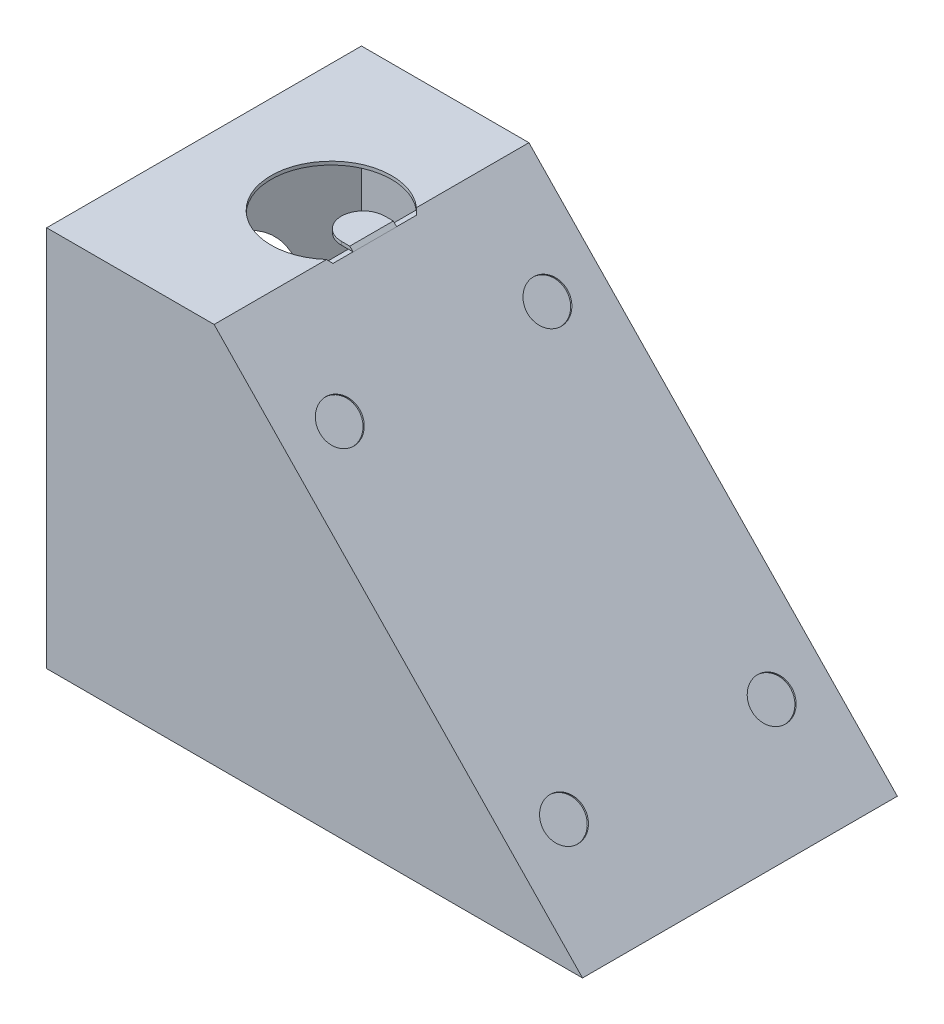
ISO-10303-21;
HEADER;
FILE_DESCRIPTION(('STEP AP214'),'2;1');
FILE_NAME('part.step','',(''),(''),'','','');
FILE_SCHEMA(('AUTOMOTIVE_DESIGN { 1 0 10303 214 1 1 1 1 }'));
ENDSEC;
DATA;
#1=APPLICATION_CONTEXT('core data for automotive mechanical design processes');
#2=APPLICATION_PROTOCOL_DEFINITION('international standard','automotive_design',2000,#1);
#3=PRODUCT_CONTEXT('',#1,'mechanical');
#4=PRODUCT('Part','Part','',(#3));
#5=PRODUCT_RELATED_PRODUCT_CATEGORY('part','',(#4));
#6=PRODUCT_DEFINITION_FORMATION('','',#4);
#7=PRODUCT_DEFINITION_CONTEXT('part definition',#1,'design');
#8=PRODUCT_DEFINITION('design','',#6,#7);
#9=PRODUCT_DEFINITION_SHAPE('','',#8);
#10=(LENGTH_UNIT() NAMED_UNIT(*) SI_UNIT(.MILLI.,.METRE.));
#11=(NAMED_UNIT(*) PLANE_ANGLE_UNIT() SI_UNIT($,.RADIAN.));
#12=(NAMED_UNIT(*) SI_UNIT($,.STERADIAN.) SOLID_ANGLE_UNIT());
#13=UNCERTAINTY_MEASURE_WITH_UNIT(LENGTH_MEASURE(1.E-05),#10,'distance_accuracy_value','');
#14=(GEOMETRIC_REPRESENTATION_CONTEXT(3) GLOBAL_UNCERTAINTY_ASSIGNED_CONTEXT((#13)) GLOBAL_UNIT_ASSIGNED_CONTEXT((#10,
#11,#12)) REPRESENTATION_CONTEXT('',''));
#15=CARTESIAN_POINT('',(0.,0.,0.));
#16=DIRECTION('',(0.,0.,1.));
#17=DIRECTION('',(1.,0.,0.));
#18=AXIS2_PLACEMENT_3D('',#15,#16,#17);
#19=CARTESIAN_POINT('',(12.517216783659,28.7796302298464,-23.876));
#20=DIRECTION('',(0.719618961972478,0.694369173833093,0.));
#21=DIRECTION('',(-0.694369173833093,0.719618961972478,0.));
#22=AXIS2_PLACEMENT_3D('',#19,#20,#21);
#23=PLANE('',#22);
#24=DIRECTION('',(-0.694369173833093,0.719618961972478,0.));
#25=VECTOR('',#24,1.);
#26=CARTESIAN_POINT('',(12.517216783659,28.7796302298464,-10.287));
#27=LINE('',#26,#25);
#28=CARTESIAN_POINT('',(40.2870354264932,0.,-10.287));
#29=VERTEX_POINT('',#28);
#30=CARTESIAN_POINT('',(40.041947707195,0.254000000000004,-10.287));
#31=VERTEX_POINT('',#30);
#32=EDGE_CURVE('E11',#29,#31,#27,.T.);
#33=ORIENTED_EDGE('',*,*,#32,.F.);
#34=DIRECTION('',(0.,0.,1.));
#35=VECTOR('',#34,1.);
#36=CARTESIAN_POINT('',(40.2870354264932,0.,-23.876));
#37=LINE('',#36,#35);
#38=CARTESIAN_POINT('',(40.2870354264932,0.,-0.254));
#39=VERTEX_POINT('',#38);
#40=EDGE_CURVE('E311',#29,#39,#37,.T.);
#41=ORIENTED_EDGE('',*,*,#40,.T.);
#42=DIRECTION('',(-0.694369173833093,0.719618961972478,0.));
#43=VECTOR('',#42,1.);
#44=CARTESIAN_POINT('',(12.517216783659,28.7796302298464,-0.254000000000001));
#45=LINE('',#44,#43);
#46=CARTESIAN_POINT('',(12.5921231457915,28.702,-0.254));
#47=VERTEX_POINT('',#46);
#48=EDGE_CURVE('E296',#39,#47,#45,.T.);
#49=ORIENTED_EDGE('',*,*,#48,.T.);
#50=DIRECTION('',(0.,0.,1.));
#51=VECTOR('',#50,1.);
#52=CARTESIAN_POINT('',(12.5921231457915,28.702,-23.876));
#53=LINE('',#52,#51);
#54=CARTESIAN_POINT('',(12.5921231457915,28.702,-8.43673453054739));
#55=VERTEX_POINT('',#54);
#56=EDGE_CURVE('E299',#55,#47,#53,.T.);
#57=ORIENTED_EDGE('',*,*,#56,.F.);
#58=CARTESIAN_POINT('',(12.5921231457915,28.702,-10.287));
#59=VERTEX_POINT('',#58);
#60=EDGE_CURVE('E249',#59,#55,#53,.T.);
#61=ORIENTED_EDGE('',*,*,#60,.F.);
#62=CARTESIAN_POINT('',(12.5921231457915,28.702,-13.589));
#63=VERTEX_POINT('',#62);
#64=EDGE_CURVE('E477',#63,#59,#53,.T.);
#65=ORIENTED_EDGE('',*,*,#64,.F.);
#66=CARTESIAN_POINT('',(12.5921231457915,28.702,-15.4392654694526));
#67=VERTEX_POINT('',#66);
#68=EDGE_CURVE('E260',#67,#63,#53,.T.);
#69=ORIENTED_EDGE('',*,*,#68,.F.);
#70=CARTESIAN_POINT('',(12.5921231457915,28.702,-23.622));
#71=VERTEX_POINT('',#70);
#72=EDGE_CURVE('E288',#71,#67,#53,.T.);
#73=ORIENTED_EDGE('',*,*,#72,.F.);
#74=DIRECTION('',(-0.694369173833093,0.719618961972478,0.));
#75=VECTOR('',#74,1.);
#76=CARTESIAN_POINT('',(12.517216783659,28.7796302298464,-23.622));
#77=LINE('',#76,#75);
#78=CARTESIAN_POINT('',(40.2870354264932,0.,-23.622));
#79=VERTEX_POINT('',#78);
#80=EDGE_CURVE('E304',#79,#71,#77,.T.);
#81=ORIENTED_EDGE('',*,*,#80,.F.);
#82=CARTESIAN_POINT('',(40.2870354264932,0.,-13.589));
#83=VERTEX_POINT('',#82);
#84=EDGE_CURVE('E313',#79,#83,#37,.T.);
#85=ORIENTED_EDGE('',*,*,#84,.T.);
#86=DIRECTION('',(0.694369173833093,-0.719618961972478,0.));
#87=VECTOR('',#86,1.);
#88=CARTESIAN_POINT('',(12.517216783659,28.7796302298464,-13.589));
#89=LINE('',#88,#87);
#90=CARTESIAN_POINT('',(40.041947707195,0.254000000000004,-13.589));
#91=VERTEX_POINT('',#90);
#92=EDGE_CURVE('E51',#91,#83,#89,.T.);
#93=ORIENTED_EDGE('',*,*,#92,.F.);
#94=DIRECTION('',(0.,0.,-1.));
#95=VECTOR('',#94,1.);
#96=CARTESIAN_POINT('',(40.041947707195,0.254000000000004,-23.876));
#97=LINE('',#96,#95);
#98=EDGE_CURVE('E61',#31,#91,#97,.T.);
#99=ORIENTED_EDGE('',*,*,#98,.F.);
#100=EDGE_LOOP('',(#33,#41,#49,#57,#61,#65,#69,#73,#81,#85,#93,#99));
#101=FACE_BOUND('',#100,.T.);
#102=ADVANCED_FACE('F42',(#101),#23,.F.);
#103=CARTESIAN_POINT('',(9.652,28.702,-11.938));
#104=DIRECTION('',(0.,1.,0.));
#105=DIRECTION('',(0.,0.,1.));
#106=AXIS2_PLACEMENT_3D('',#103,#104,#105);
#107=PLANE('',#106);
#108=DIRECTION('',(0.,0.,1.));
#109=VECTOR('',#108,1.);
#110=CARTESIAN_POINT('',(12.9450877192982,28.702,-23.876));
#111=LINE('',#110,#109);
#112=CARTESIAN_POINT('',(12.9450877192982,28.702,-10.287));
#113=VERTEX_POINT('',#112);
#114=CARTESIAN_POINT('',(12.9450877192982,28.702,-8.76644560617241));
#115=VERTEX_POINT('',#114);
#116=EDGE_CURVE('E353',#113,#115,#111,.T.);
#117=ORIENTED_EDGE('',*,*,#116,.F.);
#118=DIRECTION('',(1.,0.,0.));
#119=VECTOR('',#118,1.);
#120=CARTESIAN_POINT('',(9.652,28.702,-10.287));
#121=LINE('',#120,#119);
#122=EDGE_CURVE('E362',#59,#113,#121,.T.);
#123=ORIENTED_EDGE('',*,*,#122,.F.);
#124=ORIENTED_EDGE('',*,*,#60,.T.);
#125=CARTESIAN_POINT('',(9.652,28.702,-11.938));
#126=DIRECTION('',(0.,1.,0.));
#127=DIRECTION('',(0.,0.,1.));
#128=AXIS2_PLACEMENT_3D('',#125,#126,#127);
#129=CIRCLE('',#128,4.572);
#130=EDGE_CURVE('E246',#55,#115,#129,.T.);
#131=ORIENTED_EDGE('',*,*,#130,.T.);
#132=EDGE_LOOP('',(#117,#123,#124,#131));
#133=FACE_BOUND('',#132,.T.);
#134=ADVANCED_FACE('F379',(#133),#107,.T.);
#135=DIRECTION('',(1.,0.,0.));
#136=VECTOR('',#135,1.);
#137=CARTESIAN_POINT('',(9.652,28.702,-13.589));
#138=LINE('',#137,#136);
#139=CARTESIAN_POINT('',(12.9450877192982,28.702,-13.589));
#140=VERTEX_POINT('',#139);
#141=EDGE_CURVE('E360',#63,#140,#138,.T.);
#142=ORIENTED_EDGE('',*,*,#141,.T.);
#143=CARTESIAN_POINT('',(12.9450877192982,28.702,-15.1095543938276));
#144=VERTEX_POINT('',#143);
#145=EDGE_CURVE('E354',#144,#140,#111,.T.);
#146=ORIENTED_EDGE('',*,*,#145,.F.);
#147=EDGE_CURVE('E250',#144,#67,#129,.T.);
#148=ORIENTED_EDGE('',*,*,#147,.T.);
#149=ORIENTED_EDGE('',*,*,#68,.T.);
#150=EDGE_LOOP('',(#142,#146,#148,#149));
#151=FACE_BOUND('',#150,.T.);
#152=ADVANCED_FACE('F384',(#151),#107,.T.);
#153=CARTESIAN_POINT('',(10.414,28.702,-10.287));
#154=DIRECTION('',(0.,1.,0.));
#155=DIRECTION('',(0.,0.,1.));
#156=AXIS2_PLACEMENT_3D('',#153,#154,#155);
#157=PLANE('',#156);
#158=CARTESIAN_POINT('',(12.065,28.702,-11.938));
#159=DIRECTION('',(0.,1.,0.));
#160=DIRECTION('',(0.,0.,1.));
#161=AXIS2_PLACEMENT_3D('',#158,#159,#160);
#162=CIRCLE('',#161,1.651);
#163=CARTESIAN_POINT('',(12.0649999999999,28.702,-13.589));
#164=VERTEX_POINT('',#163);
#165=CARTESIAN_POINT('',(12.065,28.702,-10.287));
#166=VERTEX_POINT('',#165);
#167=EDGE_CURVE('E235',#164,#166,#162,.T.);
#168=ORIENTED_EDGE('',*,*,#167,.F.);
#169=DIRECTION('',(1.,0.,0.));
#170=VECTOR('',#169,1.);
#171=CARTESIAN_POINT('',(10.414,28.702,-13.589));
#172=LINE('',#171,#170);
#173=EDGE_CURVE('E241',#164,#63,#172,.T.);
#174=ORIENTED_EDGE('',*,*,#173,.T.);
#175=ORIENTED_EDGE('',*,*,#64,.T.);
#176=DIRECTION('',(1.,0.,0.));
#177=VECTOR('',#176,1.);
#178=CARTESIAN_POINT('',(10.414,28.702,-10.287));
#179=LINE('',#178,#177);
#180=EDGE_CURVE('E240',#166,#59,#179,.T.);
#181=ORIENTED_EDGE('',*,*,#180,.F.);
#182=EDGE_LOOP('',(#168,#174,#175,#181));
#183=FACE_BOUND('',#182,.T.);
#184=ADVANCED_FACE('F475',(#183),#157,.F.);
#185=CARTESIAN_POINT('',(12.7,28.956,-10.287));
#186=DIRECTION('',(0.,-1.,0.));
#187=DIRECTION('',(0.,0.,-1.));
#188=AXIS2_PLACEMENT_3D('',#185,#186,#187);
#189=PLANE('',#188);
#190=DIRECTION('',(-1.,0.,0.));
#191=VECTOR('',#190,1.);
#192=CARTESIAN_POINT('',(12.7,28.956,-10.287));
#193=LINE('',#192,#191);
#194=CARTESIAN_POINT('',(12.7,28.956,-10.287));
#195=VERTEX_POINT('',#194);
#196=CARTESIAN_POINT('',(12.065,28.956,-10.287));
#197=VERTEX_POINT('',#196);
#198=EDGE_CURVE('E238',#195,#197,#193,.T.);
#199=ORIENTED_EDGE('',*,*,#198,.F.);
#200=DIRECTION('',(0.,0.,1.));
#201=VECTOR('',#200,1.);
#202=CARTESIAN_POINT('',(12.7,28.956,-14.605));
#203=LINE('',#202,#201);
#204=CARTESIAN_POINT('',(12.7,28.956,-13.589));
#205=VERTEX_POINT('',#204);
#206=EDGE_CURVE('E213',#205,#195,#203,.T.);
#207=ORIENTED_EDGE('',*,*,#206,.F.);
#208=DIRECTION('',(-1.,0.,0.));
#209=VECTOR('',#208,1.);
#210=CARTESIAN_POINT('',(12.7,28.956,-13.589));
#211=LINE('',#210,#209);
#212=CARTESIAN_POINT('',(12.0649999999999,28.956,-13.589));
#213=VERTEX_POINT('',#212);
#214=EDGE_CURVE('E237',#205,#213,#211,.T.);
#215=ORIENTED_EDGE('',*,*,#214,.T.);
#216=CARTESIAN_POINT('',(12.065,28.956,-11.938));
#217=DIRECTION('',(0.,1.,0.));
#218=DIRECTION('',(0.,0.,1.));
#219=AXIS2_PLACEMENT_3D('',#216,#217,#218);
#220=CIRCLE('',#219,1.651);
#221=EDGE_CURVE('E232',#213,#197,#220,.T.);
#222=ORIENTED_EDGE('',*,*,#221,.T.);
#223=EDGE_LOOP('',(#199,#207,#215,#222));
#224=FACE_BOUND('',#223,.T.);
#225=ADVANCED_FACE('F418',(#224),#189,.F.);
#226=CARTESIAN_POINT('',(0.,0.,-23.876));
#227=DIRECTION('',(0.,-1.,0.));
#228=DIRECTION('',(0.,0.,-1.));
#229=AXIS2_PLACEMENT_3D('',#226,#227,#228);
#230=PLANE('',#229);
#231=DIRECTION('',(1.,0.,0.));
#232=VECTOR('',#231,1.);
#233=CARTESIAN_POINT('',(0.,0.,0.));
#234=LINE('',#233,#232);
#235=CARTESIAN_POINT('',(0.,0.,0.));
#236=VERTEX_POINT('',#235);
#237=CARTESIAN_POINT('',(40.64,0.,0.));
#238=VERTEX_POINT('',#237);
#239=EDGE_CURVE('E333',#236,#238,#234,.T.);
#240=ORIENTED_EDGE('',*,*,#239,.F.);
#241=DIRECTION('',(0.,0.,1.));
#242=VECTOR('',#241,1.);
#243=CARTESIAN_POINT('',(0.,0.,-23.876));
#244=LINE('',#243,#242);
#245=CARTESIAN_POINT('',(0.,0.,-23.876));
#246=VERTEX_POINT('',#245);
#247=EDGE_CURVE('E330',#246,#236,#244,.T.);
#248=ORIENTED_EDGE('',*,*,#247,.F.);
#249=DIRECTION('',(1.,0.,0.));
#250=VECTOR('',#249,1.);
#251=CARTESIAN_POINT('',(0.,0.,-23.876));
#252=LINE('',#251,#250);
#253=CARTESIAN_POINT('',(40.64,0.,-23.876));
#254=VERTEX_POINT('',#253);
#255=EDGE_CURVE('E320',#246,#254,#252,.T.);
#256=ORIENTED_EDGE('',*,*,#255,.T.);
#257=DIRECTION('',(0.,0.,1.));
#258=VECTOR('',#257,1.);
#259=CARTESIAN_POINT('',(40.64,0.,-23.876));
#260=LINE('',#259,#258);
#261=EDGE_CURVE('E348',#254,#238,#260,.T.);
#262=ORIENTED_EDGE('',*,*,#261,.T.);
#263=EDGE_LOOP('',(#240,#248,#256,#262));
#264=FACE_BOUND('',#263,.T.);
#265=DIRECTION('',(0.,0.,1.));
#266=VECTOR('',#265,1.);
#267=CARTESIAN_POINT('',(0.254,0.,-23.876));
#268=LINE('',#267,#266);
#269=CARTESIAN_POINT('',(0.254,0.,-23.622));
#270=VERTEX_POINT('',#269);
#271=CARTESIAN_POINT('',(0.254,0.,-0.254));
#272=VERTEX_POINT('',#271);
#273=EDGE_CURVE('E303',#270,#272,#268,.T.);
#274=ORIENTED_EDGE('',*,*,#273,.T.);
#275=DIRECTION('',(1.,0.,0.));
#276=VECTOR('',#275,1.);
#277=CARTESIAN_POINT('',(0.,0.,-0.254000000000001));
#278=LINE('',#277,#276);
#279=EDGE_CURVE('E284',#272,#39,#278,.T.);
#280=ORIENTED_EDGE('',*,*,#279,.T.);
#281=ORIENTED_EDGE('',*,*,#40,.F.);
#282=DIRECTION('',(1.,0.,0.));
#283=VECTOR('',#282,1.);
#284=CARTESIAN_POINT('',(0.,0.,-10.287));
#285=LINE('',#284,#283);
#286=CARTESIAN_POINT('',(39.6520354264932,0.,-10.287));
#287=VERTEX_POINT('',#286);
#288=EDGE_CURVE('E208',#287,#29,#285,.T.);
#289=ORIENTED_EDGE('',*,*,#288,.F.);
#290=CARTESIAN_POINT('',(39.6520354264932,0.,-11.938));
#291=DIRECTION('',(0.,-1.,0.));
#292=DIRECTION('',(0.,0.,-1.));
#293=AXIS2_PLACEMENT_3D('',#290,#291,#292);
#294=CIRCLE('',#293,1.651);
#295=CARTESIAN_POINT('',(39.6520354264932,0.,-13.589));
#296=VERTEX_POINT('',#295);
#297=EDGE_CURVE('E189',#287,#296,#294,.T.);
#298=ORIENTED_EDGE('',*,*,#297,.T.);
#299=DIRECTION('',(-1.,0.,0.));
#300=VECTOR('',#299,1.);
#301=CARTESIAN_POINT('',(0.,0.,-13.589));
#302=LINE('',#301,#300);
#303=EDGE_CURVE('E200',#83,#296,#302,.T.);
#304=ORIENTED_EDGE('',*,*,#303,.F.);
#305=ORIENTED_EDGE('',*,*,#84,.F.);
#306=DIRECTION('',(1.,0.,0.));
#307=VECTOR('',#306,1.);
#308=CARTESIAN_POINT('',(0.,0.,-23.622));
#309=LINE('',#308,#307);
#310=EDGE_CURVE('E292',#270,#79,#309,.T.);
#311=ORIENTED_EDGE('',*,*,#310,.F.);
#312=EDGE_LOOP('',(#274,#280,#281,#289,#298,#304,#305,#311));
#313=FACE_BOUND('',#312,.T.);
#314=ADVANCED_FACE('F375',(#264,#313),#230,.T.);
#315=CARTESIAN_POINT('',(0.,0.,-23.876));
#316=DIRECTION('',(-1.,0.,0.));
#317=DIRECTION('',(0.,0.,1.));
#318=AXIS2_PLACEMENT_3D('',#315,#316,#317);
#319=PLANE('',#318);
#320=CARTESIAN_POINT('',(0.,14.859,-11.938));
#321=DIRECTION('',(-1.,0.,0.));
#322=DIRECTION('',(0.,0.,1.));
#323=AXIS2_PLACEMENT_3D('',#320,#321,#322);
#324=CIRCLE('',#323,7.49300000000001);
#325=CARTESIAN_POINT('',(0.,14.859,-4.44499999999999));
#326=VERTEX_POINT('',#325);
#327=EDGE_CURVE('E343',#326,#326,#324,.F.);
#328=ORIENTED_EDGE('',*,*,#327,.T.);
#329=EDGE_LOOP('',(#328));
#330=FACE_BOUND('',#329,.T.);
#331=DIRECTION('',(0.,-1.,0.));
#332=VECTOR('',#331,1.);
#333=CARTESIAN_POINT('',(0.,0.,0.));
#334=LINE('',#333,#332);
#335=CARTESIAN_POINT('',(0.,28.956,0.));
#336=VERTEX_POINT('',#335);
#337=EDGE_CURVE('E287',#336,#236,#334,.T.);
#338=ORIENTED_EDGE('',*,*,#337,.F.);
#339=DIRECTION('',(0.,0.,1.));
#340=VECTOR('',#339,1.);
#341=CARTESIAN_POINT('',(0.,28.956,-23.876));
#342=LINE('',#341,#340);
#343=CARTESIAN_POINT('',(0.,28.956,-23.876));
#344=VERTEX_POINT('',#343);
#345=EDGE_CURVE('E341',#344,#336,#342,.T.);
#346=ORIENTED_EDGE('',*,*,#345,.F.);
#347=DIRECTION('',(0.,-1.,0.));
#348=VECTOR('',#347,1.);
#349=CARTESIAN_POINT('',(0.,0.,-23.876));
#350=LINE('',#349,#348);
#351=EDGE_CURVE('E317',#344,#246,#350,.T.);
#352=ORIENTED_EDGE('',*,*,#351,.T.);
#353=ORIENTED_EDGE('',*,*,#247,.T.);
#354=EDGE_LOOP('',(#338,#346,#352,#353));
#355=FACE_BOUND('',#354,.T.);
#356=ADVANCED_FACE('F412',(#330,#355),#319,.T.);
#357=CARTESIAN_POINT('',(0.,28.956,-23.876));
#358=DIRECTION('',(0.,1.,0.));
#359=DIRECTION('',(0.,0.,1.));
#360=AXIS2_PLACEMENT_3D('',#357,#358,#359);
#361=PLANE('',#360);
#362=CARTESIAN_POINT('',(9.652,28.956,-11.938));
#363=DIRECTION('',(0.,1.,0.));
#364=DIRECTION('',(0.,0.,1.));
#365=AXIS2_PLACEMENT_3D('',#362,#363,#364);
#366=CIRCLE('',#365,4.572);
#367=CARTESIAN_POINT('',(12.7,28.956,-15.3457675977097));
#368=VERTEX_POINT('',#367);
#369=CARTESIAN_POINT('',(12.7,28.956,-8.53023240229032));
#370=VERTEX_POINT('',#369);
#371=EDGE_CURVE('E243',#368,#370,#366,.T.);
#372=ORIENTED_EDGE('',*,*,#371,.F.);
#373=DIRECTION('',(0.,0.,1.));
#374=VECTOR('',#373,1.);
#375=CARTESIAN_POINT('',(12.7,28.956,-23.876));
#376=LINE('',#375,#374);
#377=CARTESIAN_POINT('',(12.7,28.956,-23.876));
#378=VERTEX_POINT('',#377);
#379=EDGE_CURVE('E344',#378,#368,#376,.T.);
#380=ORIENTED_EDGE('',*,*,#379,.F.);
#381=DIRECTION('',(-1.,0.,0.));
#382=VECTOR('',#381,1.);
#383=CARTESIAN_POINT('',(0.,28.956,-23.876));
#384=LINE('',#383,#382);
#385=EDGE_CURVE('E327',#378,#344,#384,.T.);
#386=ORIENTED_EDGE('',*,*,#385,.T.);
#387=ORIENTED_EDGE('',*,*,#345,.T.);
#388=DIRECTION('',(-1.,0.,0.));
#389=VECTOR('',#388,1.);
#390=CARTESIAN_POINT('',(0.,28.956,0.));
#391=LINE('',#390,#389);
#392=CARTESIAN_POINT('',(12.7,28.956,0.));
#393=VERTEX_POINT('',#392);
#394=EDGE_CURVE('E321',#393,#336,#391,.T.);
#395=ORIENTED_EDGE('',*,*,#394,.F.);
#396=EDGE_CURVE('E347',#370,#393,#376,.T.);
#397=ORIENTED_EDGE('',*,*,#396,.F.);
#398=EDGE_LOOP('',(#372,#380,#386,#387,#395,#397));
#399=FACE_BOUND('',#398,.T.);
#400=ADVANCED_FACE('F409',(#399),#361,.T.);
#401=CARTESIAN_POINT('',(12.7,28.956,-23.876));
#402=DIRECTION('',(0.719618961972478,0.694369173833093,0.));
#403=DIRECTION('',(-0.694369173833093,0.719618961972478,0.));
#404=AXIS2_PLACEMENT_3D('',#401,#402,#403);
#405=PLANE('',#404);
#406=CARTESIAN_POINT('',(9.652,32.1148363636364,-11.938));
#407=DIRECTION('',(0.719618961972478,0.694369173833093,0.));
#408=DIRECTION('',(-0.694369173833093,0.719618961972478,0.));
#409=AXIS2_PLACEMENT_3D('',#406,#407,#408);
#410=ELLIPSE('',#409,6.58439368032628,4.572);
#411=EDGE_CURVE('E359',#370,#115,#410,.T.);
#412=ORIENTED_EDGE('',*,*,#411,.F.);
#413=ORIENTED_EDGE('',*,*,#396,.T.);
#414=DIRECTION('',(-0.694369173833093,0.719618961972478,0.));
#415=VECTOR('',#414,1.);
#416=CARTESIAN_POINT('',(12.7,28.956,0.));
#417=LINE('',#416,#415);
#418=EDGE_CURVE('E336',#238,#393,#417,.T.);
#419=ORIENTED_EDGE('',*,*,#418,.F.);
#420=ORIENTED_EDGE('',*,*,#261,.F.);
#421=DIRECTION('',(-0.694369173833093,0.719618961972478,0.));
#422=VECTOR('',#421,1.);
#423=CARTESIAN_POINT('',(12.7,28.956,-23.876));
#424=LINE('',#423,#422);
#425=EDGE_CURVE('E324',#254,#378,#424,.T.);
#426=ORIENTED_EDGE('',*,*,#425,.T.);
#427=ORIENTED_EDGE('',*,*,#379,.T.);
#428=EDGE_CURVE('E357',#144,#368,#410,.T.);
#429=ORIENTED_EDGE('',*,*,#428,.F.);
#430=ORIENTED_EDGE('',*,*,#145,.T.);
#431=DIRECTION('',(0.,0.,1.));
#432=VECTOR('',#431,1.);
#433=CARTESIAN_POINT('',(12.9450877192982,28.702,-23.876));
#434=LINE('',#433,#432);
#435=EDGE_CURVE('E229',#140,#113,#434,.T.);
#436=ORIENTED_EDGE('',*,*,#435,.T.);
#437=ORIENTED_EDGE('',*,*,#116,.T.);
#438=EDGE_LOOP('',(#412,#413,#419,#420,#426,#427,#429,#430,#436,#437));
#439=FACE_BOUND('',#438,.T.);
#440=CARTESIAN_POINT('',(35.1725371252382,5.66627970657129,-19.812));
#441=DIRECTION('',(0.719618961972478,0.694369173833093,0.));
#442=DIRECTION('',(-0.694369173833093,0.719618961972478,0.));
#443=AXIS2_PLACEMENT_3D('',#440,#441,#442);
#444=CIRCLE('',#443,1.524);
#445=CARTESIAN_POINT('',(34.1143185043166,6.76297900461735,-19.812));
#446=VERTEX_POINT('',#445);
#447=EDGE_CURVE('E261',#446,#446,#444,.T.);
#448=ORIENTED_EDGE('',*,*,#447,.F.);
#449=EDGE_LOOP('',(#448));
#450=FACE_BOUND('',#449,.T.);
#451=CARTESIAN_POINT('',(18.1674628747618,23.2897202934287,-4.064));
#452=DIRECTION('',(0.719618961972478,0.694369173833093,0.));
#453=DIRECTION('',(-0.694369173833093,0.719618961972478,0.));
#454=AXIS2_PLACEMENT_3D('',#451,#452,#453);
#455=CIRCLE('',#454,1.524);
#456=CARTESIAN_POINT('',(17.1092442538401,24.3864195914748,-4.064));
#457=VERTEX_POINT('',#456);
#458=EDGE_CURVE('E268',#457,#457,#455,.T.);
#459=ORIENTED_EDGE('',*,*,#458,.F.);
#460=EDGE_LOOP('',(#459));
#461=FACE_BOUND('',#460,.T.);
#462=CARTESIAN_POINT('',(35.1725371252382,5.66627970657129,-4.064));
#463=DIRECTION('',(0.719618961972478,0.694369173833093,0.));
#464=DIRECTION('',(-0.694369173833093,0.719618961972478,0.));
#465=AXIS2_PLACEMENT_3D('',#462,#463,#464);
#466=CIRCLE('',#465,1.524);
#467=CARTESIAN_POINT('',(34.1143185043166,6.76297900461735,-4.064));
#468=VERTEX_POINT('',#467);
#469=EDGE_CURVE('E253',#468,#468,#466,.T.);
#470=ORIENTED_EDGE('',*,*,#469,.F.);
#471=EDGE_LOOP('',(#470));
#472=FACE_BOUND('',#471,.T.);
#473=CARTESIAN_POINT('',(18.1674628747618,23.2897202934287,-19.812));
#474=DIRECTION('',(0.719618961972478,0.694369173833093,0.));
#475=DIRECTION('',(-0.694369173833093,0.719618961972478,0.));
#476=AXIS2_PLACEMENT_3D('',#473,#474,#475);
#477=CIRCLE('',#476,1.524);
#478=CARTESIAN_POINT('',(17.1092442538401,24.3864195914748,-19.812));
#479=VERTEX_POINT('',#478);
#480=EDGE_CURVE('E264',#479,#479,#477,.T.);
#481=ORIENTED_EDGE('',*,*,#480,.F.);
#482=EDGE_LOOP('',(#481));
#483=FACE_BOUND('',#482,.T.);
#484=ADVANCED_FACE('F403',(#439,#450,#461,#472,#483),#405,.T.);
#485=CARTESIAN_POINT('',(0.,0.,-23.876));
#486=DIRECTION('',(0.,0.,-1.));
#487=DIRECTION('',(-1.,0.,0.));
#488=AXIS2_PLACEMENT_3D('',#485,#486,#487);
#489=PLANE('',#488);
#490=ORIENTED_EDGE('',*,*,#351,.F.);
#491=ORIENTED_EDGE('',*,*,#385,.F.);
#492=ORIENTED_EDGE('',*,*,#425,.F.);
#493=ORIENTED_EDGE('',*,*,#255,.F.);
#494=EDGE_LOOP('',(#490,#491,#492,#493));
#495=FACE_BOUND('',#494,.T.);
#496=ADVANCED_FACE('F399',(#495),#489,.T.);
#497=CARTESIAN_POINT('',(0.,0.,0.));
#498=DIRECTION('',(0.,0.,-1.));
#499=DIRECTION('',(-1.,0.,0.));
#500=AXIS2_PLACEMENT_3D('',#497,#498,#499);
#501=PLANE('',#500);
#502=ORIENTED_EDGE('',*,*,#337,.T.);
#503=ORIENTED_EDGE('',*,*,#239,.T.);
#504=ORIENTED_EDGE('',*,*,#418,.T.);
#505=ORIENTED_EDGE('',*,*,#394,.T.);
#506=EDGE_LOOP('',(#502,#503,#504,#505));
#507=FACE_BOUND('',#506,.T.);
#508=ADVANCED_FACE('F402',(#507),#501,.F.);
#509=CARTESIAN_POINT('',(0.254,0.,-23.876));
#510=DIRECTION('',(-1.,0.,0.));
#511=DIRECTION('',(0.,0.,1.));
#512=AXIS2_PLACEMENT_3D('',#509,#510,#511);
#513=PLANE('',#512);
#514=CARTESIAN_POINT('',(0.254,14.859,-11.938));
#515=DIRECTION('',(-1.,0.,0.));
#516=DIRECTION('',(0.,0.,1.));
#517=AXIS2_PLACEMENT_3D('',#514,#515,#516);
#518=CIRCLE('',#517,7.239);
#519=CARTESIAN_POINT('',(0.254,14.859,-4.699));
#520=VERTEX_POINT('',#519);
#521=EDGE_CURVE('E276',#520,#520,#518,.T.);
#522=ORIENTED_EDGE('',*,*,#521,.T.);
#523=EDGE_LOOP('',(#522));
#524=FACE_BOUND('',#523,.T.);
#525=DIRECTION('',(0.,-1.,0.));
#526=VECTOR('',#525,1.);
#527=CARTESIAN_POINT('',(0.254,0.,-0.254000000000001));
#528=LINE('',#527,#526);
#529=CARTESIAN_POINT('',(0.254,28.702,-0.254));
#530=VERTEX_POINT('',#529);
#531=EDGE_CURVE('E281',#530,#272,#528,.T.);
#532=ORIENTED_EDGE('',*,*,#531,.T.);
#533=ORIENTED_EDGE('',*,*,#273,.F.);
#534=DIRECTION('',(0.,-1.,0.));
#535=VECTOR('',#534,1.);
#536=CARTESIAN_POINT('',(0.254,0.,-23.622));
#537=LINE('',#536,#535);
#538=CARTESIAN_POINT('',(0.254,28.702,-23.622));
#539=VERTEX_POINT('',#538);
#540=EDGE_CURVE('E289',#539,#270,#537,.T.);
#541=ORIENTED_EDGE('',*,*,#540,.F.);
#542=DIRECTION('',(0.,0.,1.));
#543=VECTOR('',#542,1.);
#544=CARTESIAN_POINT('',(0.254,28.702,-23.876));
#545=LINE('',#544,#543);
#546=EDGE_CURVE('E285',#539,#530,#545,.T.);
#547=ORIENTED_EDGE('',*,*,#546,.T.);
#548=EDGE_LOOP('',(#532,#533,#541,#547));
#549=FACE_BOUND('',#548,.T.);
#550=ADVANCED_FACE('F407',(#524,#549),#513,.F.);
#551=CARTESIAN_POINT('',(0.,28.702,-23.876));
#552=DIRECTION('',(0.,1.,0.));
#553=DIRECTION('',(0.,0.,1.));
#554=AXIS2_PLACEMENT_3D('',#551,#552,#553);
#555=PLANE('',#554);
#556=ORIENTED_EDGE('',*,*,#72,.T.);
#557=EDGE_CURVE('E251',#67,#55,#129,.T.);
#558=ORIENTED_EDGE('',*,*,#557,.T.);
#559=ORIENTED_EDGE('',*,*,#56,.T.);
#560=DIRECTION('',(-1.,0.,0.));
#561=VECTOR('',#560,1.);
#562=CARTESIAN_POINT('',(0.,28.702,-0.254000000000001));
#563=LINE('',#562,#561);
#564=EDGE_CURVE('E293',#47,#530,#563,.T.);
#565=ORIENTED_EDGE('',*,*,#564,.T.);
#566=ORIENTED_EDGE('',*,*,#546,.F.);
#567=DIRECTION('',(-1.,0.,0.));
#568=VECTOR('',#567,1.);
#569=CARTESIAN_POINT('',(0.,28.702,-23.622));
#570=LINE('',#569,#568);
#571=EDGE_CURVE('E300',#71,#539,#570,.T.);
#572=ORIENTED_EDGE('',*,*,#571,.F.);
#573=EDGE_LOOP('',(#556,#558,#559,#565,#566,#572));
#574=FACE_BOUND('',#573,.T.);
#575=ADVANCED_FACE('F389',(#574),#555,.F.);
#576=CARTESIAN_POINT('',(0.,0.,-23.622));
#577=DIRECTION('',(0.,0.,-1.));
#578=DIRECTION('',(-1.,0.,0.));
#579=AXIS2_PLACEMENT_3D('',#576,#577,#578);
#580=PLANE('',#579);
#581=ORIENTED_EDGE('',*,*,#540,.T.);
#582=ORIENTED_EDGE('',*,*,#310,.T.);
#583=ORIENTED_EDGE('',*,*,#80,.T.);
#584=ORIENTED_EDGE('',*,*,#571,.T.);
#585=EDGE_LOOP('',(#581,#582,#583,#584));
#586=FACE_BOUND('',#585,.T.);
#587=ADVANCED_FACE('F391',(#586),#580,.F.);
#588=CARTESIAN_POINT('',(0.,0.,-0.254));
#589=DIRECTION('',(0.,0.,-1.));
#590=DIRECTION('',(-1.,0.,0.));
#591=AXIS2_PLACEMENT_3D('',#588,#589,#590);
#592=PLANE('',#591);
#593=ORIENTED_EDGE('',*,*,#531,.F.);
#594=ORIENTED_EDGE('',*,*,#564,.F.);
#595=ORIENTED_EDGE('',*,*,#48,.F.);
#596=ORIENTED_EDGE('',*,*,#279,.F.);
#597=EDGE_LOOP('',(#593,#594,#595,#596));
#598=FACE_BOUND('',#597,.T.);
#599=ADVANCED_FACE('F394',(#598),#592,.T.);
#600=CARTESIAN_POINT('',(0.254000000000013,14.859,-11.938));
#601=DIRECTION('',(-1.,0.,0.));
#602=DIRECTION('',(0.,0.,1.));
#603=AXIS2_PLACEMENT_3D('',#600,#601,#602);
#604=CONICAL_SURFACE('',#603,7.239,0.785398163397443);
#605=ORIENTED_EDGE('',*,*,#327,.F.);
#606=EDGE_LOOP('',(#605));
#607=FACE_BOUND('',#606,.T.);
#608=ORIENTED_EDGE('',*,*,#521,.F.);
#609=EDGE_LOOP('',(#608));
#610=FACE_BOUND('',#609,.T.);
#611=ADVANCED_FACE('F45',(#607,#610),#604,.F.);
#612=CARTESIAN_POINT('',(18.0760712665913,23.2015354083519,-19.812));
#613=DIRECTION('',(0.719618961972478,0.694369173833093,0.));
#614=DIRECTION('',(-0.694369173833093,0.719618961972478,0.));
#615=AXIS2_PLACEMENT_3D('',#612,#613,#614);
#616=CYLINDRICAL_SURFACE('',#615,1.524);
#617=CARTESIAN_POINT('',(18.0760712665913,23.2015354083519,-19.812));
#618=DIRECTION('',(0.719618961972478,0.694369173833093,0.));
#619=DIRECTION('',(-0.694369173833093,0.719618961972478,0.));
#620=AXIS2_PLACEMENT_3D('',#617,#618,#619);
#621=CIRCLE('',#620,1.524);
#622=CARTESIAN_POINT('',(17.0178526456696,24.298234706398,-19.812));
#623=VERTEX_POINT('',#622);
#624=EDGE_CURVE('E273',#623,#623,#621,.T.);
#625=ORIENTED_EDGE('',*,*,#624,.F.);
#626=EDGE_LOOP('',(#625));
#627=FACE_BOUND('',#626,.T.);
#628=ORIENTED_EDGE('',*,*,#480,.T.);
#629=EDGE_LOOP('',(#628));
#630=FACE_BOUND('',#629,.T.);
#631=ADVANCED_FACE('F526',(#627,#630),#616,.F.);
#632=CARTESIAN_POINT('',(18.0760712665913,23.2015354083519,-19.812));
#633=DIRECTION('',(0.719618961972478,0.694369173833093,0.));
#634=DIRECTION('',(-0.694369173833093,0.719618961972478,0.));
#635=AXIS2_PLACEMENT_3D('',#632,#633,#634);
#636=PLANE('',#635);
#637=ORIENTED_EDGE('',*,*,#624,.T.);
#638=EDGE_LOOP('',(#637));
#639=FACE_BOUND('',#638,.T.);
#640=ADVANCED_FACE('F504',(#639),#636,.T.);
#641=CARTESIAN_POINT('',(35.0811455170677,5.57809482149449,-4.064));
#642=DIRECTION('',(0.719618961972478,0.694369173833093,0.));
#643=DIRECTION('',(-0.694369173833093,0.719618961972478,0.));
#644=AXIS2_PLACEMENT_3D('',#641,#642,#643);
#645=CYLINDRICAL_SURFACE('',#644,1.524);
#646=CARTESIAN_POINT('',(35.0811455170677,5.57809482149449,-4.064));
#647=DIRECTION('',(0.719618961972478,0.694369173833093,0.));
#648=DIRECTION('',(-0.694369173833093,0.719618961972478,0.));
#649=AXIS2_PLACEMENT_3D('',#646,#647,#648);
#650=CIRCLE('',#649,1.524);
#651=CARTESIAN_POINT('',(34.0229268961461,6.67479411954055,-4.064));
#652=VERTEX_POINT('',#651);
#653=EDGE_CURVE('E257',#652,#652,#650,.T.);
#654=ORIENTED_EDGE('',*,*,#653,.F.);
#655=EDGE_LOOP('',(#654));
#656=FACE_BOUND('',#655,.T.);
#657=ORIENTED_EDGE('',*,*,#469,.T.);
#658=EDGE_LOOP('',(#657));
#659=FACE_BOUND('',#658,.T.);
#660=ADVANCED_FACE('F500',(#656,#659),#645,.F.);
#661=CARTESIAN_POINT('',(35.0811455170677,5.57809482149449,-4.064));
#662=DIRECTION('',(0.719618961972478,0.694369173833093,0.));
#663=DIRECTION('',(-0.694369173833093,0.719618961972478,0.));
#664=AXIS2_PLACEMENT_3D('',#661,#662,#663);
#665=PLANE('',#664);
#666=ORIENTED_EDGE('',*,*,#653,.T.);
#667=EDGE_LOOP('',(#666));
#668=FACE_BOUND('',#667,.T.);
#669=ADVANCED_FACE('F503',(#668),#665,.T.);
#670=CARTESIAN_POINT('',(18.0760712665913,23.2015354083519,-4.064));
#671=DIRECTION('',(0.719618961972478,0.694369173833093,0.));
#672=DIRECTION('',(-0.694369173833093,0.719618961972478,0.));
#673=AXIS2_PLACEMENT_3D('',#670,#671,#672);
#674=CYLINDRICAL_SURFACE('',#673,1.524);
#675=CARTESIAN_POINT('',(18.0760712665913,23.2015354083519,-4.064));
#676=DIRECTION('',(0.719618961972478,0.694369173833093,0.));
#677=DIRECTION('',(-0.694369173833093,0.719618961972478,0.));
#678=AXIS2_PLACEMENT_3D('',#675,#676,#677);
#679=CIRCLE('',#678,1.524);
#680=CARTESIAN_POINT('',(17.0178526456696,24.298234706398,-4.064));
#681=VERTEX_POINT('',#680);
#682=EDGE_CURVE('E256',#681,#681,#679,.T.);
#683=ORIENTED_EDGE('',*,*,#682,.F.);
#684=EDGE_LOOP('',(#683));
#685=FACE_BOUND('',#684,.T.);
#686=ORIENTED_EDGE('',*,*,#458,.T.);
#687=EDGE_LOOP('',(#686));
#688=FACE_BOUND('',#687,.T.);
#689=ADVANCED_FACE('F508',(#685,#688),#674,.F.);
#690=CARTESIAN_POINT('',(18.0760712665913,23.2015354083519,-4.064));
#691=DIRECTION('',(0.719618961972478,0.694369173833093,0.));
#692=DIRECTION('',(-0.694369173833093,0.719618961972478,0.));
#693=AXIS2_PLACEMENT_3D('',#690,#691,#692);
#694=PLANE('',#693);
#695=ORIENTED_EDGE('',*,*,#682,.T.);
#696=EDGE_LOOP('',(#695));
#697=FACE_BOUND('',#696,.T.);
#698=ADVANCED_FACE('F513',(#697),#694,.T.);
#699=CARTESIAN_POINT('',(35.0811455170677,5.57809482149449,-19.812));
#700=DIRECTION('',(0.719618961972478,0.694369173833093,0.));
#701=DIRECTION('',(-0.694369173833093,0.719618961972478,0.));
#702=AXIS2_PLACEMENT_3D('',#699,#700,#701);
#703=CYLINDRICAL_SURFACE('',#702,1.524);
#704=CARTESIAN_POINT('',(35.0811455170677,5.57809482149449,-19.812));
#705=DIRECTION('',(0.719618961972478,0.694369173833093,0.));
#706=DIRECTION('',(-0.694369173833093,0.719618961972478,0.));
#707=AXIS2_PLACEMENT_3D('',#704,#705,#706);
#708=CIRCLE('',#707,1.524);
#709=CARTESIAN_POINT('',(34.0229268961461,6.67479411954055,-19.812));
#710=VERTEX_POINT('',#709);
#711=EDGE_CURVE('E265',#710,#710,#708,.T.);
#712=ORIENTED_EDGE('',*,*,#711,.F.);
#713=EDGE_LOOP('',(#712));
#714=FACE_BOUND('',#713,.T.);
#715=ORIENTED_EDGE('',*,*,#447,.T.);
#716=EDGE_LOOP('',(#715));
#717=FACE_BOUND('',#716,.T.);
#718=ADVANCED_FACE('F510',(#714,#717),#703,.F.);
#719=CARTESIAN_POINT('',(35.0811455170677,5.57809482149449,-19.812));
#720=DIRECTION('',(0.719618961972478,0.694369173833093,0.));
#721=DIRECTION('',(-0.694369173833093,0.719618961972478,0.));
#722=AXIS2_PLACEMENT_3D('',#719,#720,#721);
#723=PLANE('',#722);
#724=ORIENTED_EDGE('',*,*,#711,.T.);
#725=EDGE_LOOP('',(#724));
#726=FACE_BOUND('',#725,.T.);
#727=ADVANCED_FACE('F499',(#726),#723,.T.);
#728=CARTESIAN_POINT('',(9.652,28.702,-11.938));
#729=DIRECTION('',(0.,1.,0.));
#730=DIRECTION('',(0.,0.,1.));
#731=AXIS2_PLACEMENT_3D('',#728,#729,#730);
#732=CYLINDRICAL_SURFACE('',#731,4.572);
#733=ORIENTED_EDGE('',*,*,#411,.T.);
#734=ORIENTED_EDGE('',*,*,#130,.F.);
#735=ORIENTED_EDGE('',*,*,#557,.F.);
#736=ORIENTED_EDGE('',*,*,#147,.F.);
#737=ORIENTED_EDGE('',*,*,#428,.T.);
#738=ORIENTED_EDGE('',*,*,#371,.T.);
#739=EDGE_LOOP('',(#733,#734,#735,#736,#737,#738));
#740=FACE_BOUND('',#739,.T.);
#741=ADVANCED_FACE('F442',(#740),#732,.F.);
#742=CARTESIAN_POINT('',(0.,0.,-10.287));
#743=DIRECTION('',(0.,0.,1.));
#744=DIRECTION('',(1.,0.,0.));
#745=AXIS2_PLACEMENT_3D('',#742,#743,#744);
#746=PLANE('',#745);
#747=DIRECTION('',(0.707106781186548,-0.707106781186548,0.));
#748=VECTOR('',#747,1.);
#749=CARTESIAN_POINT('',(20.828,20.828,-10.287));
#750=LINE('',#749,#748);
#751=CARTESIAN_POINT('',(12.954,28.702,-10.287));
#752=VERTEX_POINT('',#751);
#753=EDGE_CURVE('E219',#195,#752,#750,.T.);
#754=ORIENTED_EDGE('',*,*,#753,.F.);
#755=ORIENTED_EDGE('',*,*,#198,.T.);
#756=DIRECTION('',(0.,1.,0.));
#757=VECTOR('',#756,1.);
#758=CARTESIAN_POINT('',(12.065,25.654,-10.287));
#759=LINE('',#758,#757);
#760=EDGE_CURVE('E364',#166,#197,#759,.T.);
#761=ORIENTED_EDGE('',*,*,#760,.F.);
#762=ORIENTED_EDGE('',*,*,#180,.T.);
#763=ORIENTED_EDGE('',*,*,#122,.T.);
#764=DIRECTION('',(-1.,0.,0.));
#765=VECTOR('',#764,1.);
#766=CARTESIAN_POINT('',(12.954,28.702,-10.287));
#767=LINE('',#766,#765);
#768=EDGE_CURVE('E226',#752,#113,#767,.T.);
#769=ORIENTED_EDGE('',*,*,#768,.F.);
#770=EDGE_LOOP('',(#754,#755,#761,#762,#763,#769));
#771=FACE_BOUND('',#770,.T.);
#772=ADVANCED_FACE('F469',(#771),#746,.T.);
#773=CARTESIAN_POINT('',(0.,0.,-13.589));
#774=DIRECTION('',(0.,0.,1.));
#775=DIRECTION('',(1.,0.,0.));
#776=AXIS2_PLACEMENT_3D('',#773,#774,#775);
#777=PLANE('',#776);
#778=ORIENTED_EDGE('',*,*,#214,.F.);
#779=DIRECTION('',(0.707106781186548,-0.707106781186548,0.));
#780=VECTOR('',#779,1.);
#781=CARTESIAN_POINT('',(20.828,20.828,-13.589));
#782=LINE('',#781,#780);
#783=CARTESIAN_POINT('',(12.954,28.702,-13.589));
#784=VERTEX_POINT('',#783);
#785=EDGE_CURVE('E216',#205,#784,#782,.T.);
#786=ORIENTED_EDGE('',*,*,#785,.T.);
#787=DIRECTION('',(-1.,0.,0.));
#788=VECTOR('',#787,1.);
#789=CARTESIAN_POINT('',(12.954,28.702,-13.589));
#790=LINE('',#789,#788);
#791=EDGE_CURVE('E223',#784,#140,#790,.T.);
#792=ORIENTED_EDGE('',*,*,#791,.T.);
#793=ORIENTED_EDGE('',*,*,#141,.F.);
#794=ORIENTED_EDGE('',*,*,#173,.F.);
#795=DIRECTION('',(0.,1.,0.));
#796=VECTOR('',#795,1.);
#797=CARTESIAN_POINT('',(12.065,25.654,-13.589));
#798=LINE('',#797,#796);
#799=EDGE_CURVE('E367',#164,#213,#798,.T.);
#800=ORIENTED_EDGE('',*,*,#799,.T.);
#801=EDGE_LOOP('',(#778,#786,#792,#793,#794,#800));
#802=FACE_BOUND('',#801,.T.);
#803=ADVANCED_FACE('F457',(#802),#777,.F.);
#804=CARTESIAN_POINT('',(12.065,25.654,-11.938));
#805=DIRECTION('',(0.,1.,0.));
#806=DIRECTION('',(0.,0.,1.));
#807=AXIS2_PLACEMENT_3D('',#804,#805,#806);
#808=CYLINDRICAL_SURFACE('',#807,1.651);
#809=ORIENTED_EDGE('',*,*,#167,.T.);
#810=ORIENTED_EDGE('',*,*,#760,.T.);
#811=ORIENTED_EDGE('',*,*,#221,.F.);
#812=ORIENTED_EDGE('',*,*,#799,.F.);
#813=EDGE_LOOP('',(#809,#810,#811,#812));
#814=FACE_BOUND('',#813,.T.);
#815=ADVANCED_FACE('F472',(#814),#808,.T.);
#816=CARTESIAN_POINT('',(12.954,28.702,-10.287));
#817=DIRECTION('',(0.,1.,0.));
#818=DIRECTION('',(0.,0.,1.));
#819=AXIS2_PLACEMENT_3D('',#816,#817,#818);
#820=PLANE('',#819);
#821=ORIENTED_EDGE('',*,*,#435,.F.);
#822=ORIENTED_EDGE('',*,*,#791,.F.);
#823=DIRECTION('',(0.,0.,-1.));
#824=VECTOR('',#823,1.);
#825=CARTESIAN_POINT('',(12.954,28.702,-10.287));
#826=LINE('',#825,#824);
#827=EDGE_CURVE('E221',#752,#784,#826,.T.);
#828=ORIENTED_EDGE('',*,*,#827,.F.);
#829=ORIENTED_EDGE('',*,*,#768,.T.);
#830=EDGE_LOOP('',(#821,#822,#828,#829));
#831=FACE_BOUND('',#830,.T.);
#832=ADVANCED_FACE('F451',(#831),#820,.F.);
#833=CARTESIAN_POINT('',(12.7,28.956,-14.605));
#834=DIRECTION('',(-0.707106781186548,-0.707106781186548,0.));
#835=DIRECTION('',(0.707106781186548,-0.707106781186548,0.));
#836=AXIS2_PLACEMENT_3D('',#833,#834,#835);
#837=PLANE('',#836);
#838=ORIENTED_EDGE('',*,*,#753,.T.);
#839=ORIENTED_EDGE('',*,*,#827,.T.);
#840=ORIENTED_EDGE('',*,*,#785,.F.);
#841=ORIENTED_EDGE('',*,*,#206,.T.);
#842=EDGE_LOOP('',(#838,#839,#840,#841));
#843=FACE_BOUND('',#842,.T.);
#844=ADVANCED_FACE('F462',(#843),#837,.F.);
#845=CARTESIAN_POINT('',(0.,0.254,-10.287));
#846=DIRECTION('',(0.,0.,-1.));
#847=DIRECTION('',(-1.,0.,0.));
#848=AXIS2_PLACEMENT_3D('',#845,#846,#847);
#849=PLANE('',#848);
#850=ORIENTED_EDGE('',*,*,#288,.T.);
#851=ORIENTED_EDGE('',*,*,#32,.T.);
#852=DIRECTION('',(1.,0.,0.));
#853=VECTOR('',#852,1.);
#854=CARTESIAN_POINT('',(0.,0.254,-10.287));
#855=LINE('',#854,#853);
#856=CARTESIAN_POINT('',(39.6520354264932,0.254,-10.287));
#857=VERTEX_POINT('',#856);
#858=EDGE_CURVE('E197',#857,#31,#855,.T.);
#859=ORIENTED_EDGE('',*,*,#858,.F.);
#860=DIRECTION('',(0.,-1.,0.));
#861=VECTOR('',#860,1.);
#862=CARTESIAN_POINT('',(39.6520354264932,0.254,-10.287));
#863=LINE('',#862,#861);
#864=EDGE_CURVE('E183',#857,#287,#863,.T.);
#865=ORIENTED_EDGE('',*,*,#864,.T.);
#866=EDGE_LOOP('',(#850,#851,#859,#865));
#867=FACE_BOUND('',#866,.T.);
#868=ADVANCED_FACE('F198',(#867),#849,.F.);
#869=CARTESIAN_POINT('',(0.,0.254,-13.589));
#870=DIRECTION('',(0.,0.,1.));
#871=DIRECTION('',(1.,0.,0.));
#872=AXIS2_PLACEMENT_3D('',#869,#870,#871);
#873=PLANE('',#872);
#874=DIRECTION('',(-1.,0.,0.));
#875=VECTOR('',#874,1.);
#876=CARTESIAN_POINT('',(0.,0.254,-13.589));
#877=LINE('',#876,#875);
#878=CARTESIAN_POINT('',(39.6520354264932,0.254,-13.589));
#879=VERTEX_POINT('',#878);
#880=EDGE_CURVE('E194',#91,#879,#877,.T.);
#881=ORIENTED_EDGE('',*,*,#880,.F.);
#882=ORIENTED_EDGE('',*,*,#92,.T.);
#883=ORIENTED_EDGE('',*,*,#303,.T.);
#884=DIRECTION('',(0.,-1.,0.));
#885=VECTOR('',#884,1.);
#886=CARTESIAN_POINT('',(39.6520354264932,0.254,-13.589));
#887=LINE('',#886,#885);
#888=EDGE_CURVE('E193',#879,#296,#887,.T.);
#889=ORIENTED_EDGE('',*,*,#888,.F.);
#890=EDGE_LOOP('',(#881,#882,#883,#889));
#891=FACE_BOUND('',#890,.T.);
#892=ADVANCED_FACE('F372',(#891),#873,.F.);
#893=CARTESIAN_POINT('',(0.,0.254,0.));
#894=DIRECTION('',(0.,-1.,0.));
#895=DIRECTION('',(0.,0.,-1.));
#896=AXIS2_PLACEMENT_3D('',#893,#894,#895);
#897=PLANE('',#896);
#898=ORIENTED_EDGE('',*,*,#858,.T.);
#899=ORIENTED_EDGE('',*,*,#98,.T.);
#900=ORIENTED_EDGE('',*,*,#880,.T.);
#901=CARTESIAN_POINT('',(39.6520354264932,0.254,-11.938));
#902=DIRECTION('',(0.,-1.,0.));
#903=DIRECTION('',(0.,0.,-1.));
#904=AXIS2_PLACEMENT_3D('',#901,#902,#903);
#905=CIRCLE('',#904,1.651);
#906=EDGE_CURVE('E187',#857,#879,#905,.T.);
#907=ORIENTED_EDGE('',*,*,#906,.F.);
#908=EDGE_LOOP('',(#898,#899,#900,#907));
#909=FACE_BOUND('',#908,.T.);
#910=ADVANCED_FACE('F202',(#909),#897,.F.);
#911=CARTESIAN_POINT('',(39.6520354264932,0.254,-11.938));
#912=DIRECTION('',(0.,-1.,0.));
#913=DIRECTION('',(0.,0.,-1.));
#914=AXIS2_PLACEMENT_3D('',#911,#912,#913);
#915=CYLINDRICAL_SURFACE('',#914,1.651);
#916=ORIENTED_EDGE('',*,*,#297,.F.);
#917=ORIENTED_EDGE('',*,*,#864,.F.);
#918=ORIENTED_EDGE('',*,*,#906,.T.);
#919=ORIENTED_EDGE('',*,*,#888,.T.);
#920=EDGE_LOOP('',(#916,#917,#918,#919));
#921=FACE_BOUND('',#920,.T.);
#922=ADVANCED_FACE('F185',(#921),#915,.T.);
#923=CLOSED_SHELL('',(#102,#134,#152,#184,#225,#314,#356,#400,#484,#496,#508,#550,#575,#587,
#599,#611,#631,#640,#660,#669,#689,#698,#718,#727,#741,#772,#803,#815,#832,#844,#868,#892,#910,#922));
#924=MANIFOLD_SOLID_BREP('B2',#923);
#925=ADVANCED_BREP_SHAPE_REPRESENTATION('',(#18,#924),#14);
#926=SHAPE_DEFINITION_REPRESENTATION(#9,#925);
ENDSEC;
END-ISO-10303-21;
